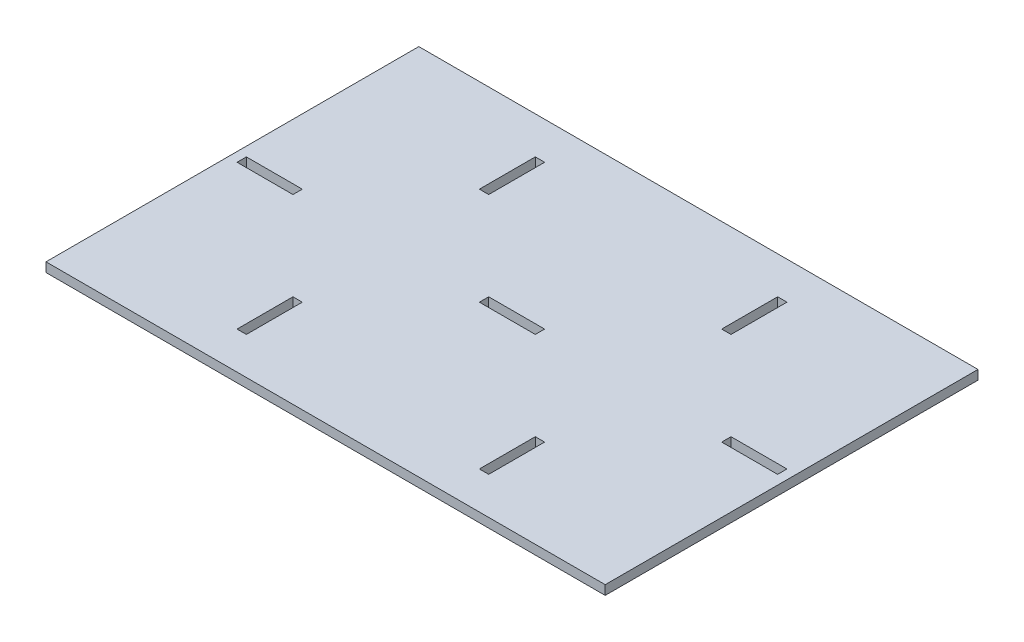
ISO-10303-21;
HEADER;
FILE_DESCRIPTION(('STEP AP214'),'2;1');
FILE_NAME('part.step','',(''),(''),'','','');
FILE_SCHEMA(('AUTOMOTIVE_DESIGN { 1 0 10303 214 1 1 1 1 }'));
ENDSEC;
DATA;
#1=APPLICATION_CONTEXT('core data for automotive mechanical design processes');
#2=APPLICATION_PROTOCOL_DEFINITION('international standard','automotive_design',2000,#1);
#3=PRODUCT_CONTEXT('',#1,'mechanical');
#4=PRODUCT('Part','Part','',(#3));
#5=PRODUCT_RELATED_PRODUCT_CATEGORY('part','',(#4));
#6=PRODUCT_DEFINITION_FORMATION('','',#4);
#7=PRODUCT_DEFINITION_CONTEXT('part definition',#1,'design');
#8=PRODUCT_DEFINITION('design','',#6,#7);
#9=PRODUCT_DEFINITION_SHAPE('','',#8);
#10=(LENGTH_UNIT() NAMED_UNIT(*) SI_UNIT(.MILLI.,.METRE.));
#11=(NAMED_UNIT(*) PLANE_ANGLE_UNIT() SI_UNIT($,.RADIAN.));
#12=(NAMED_UNIT(*) SI_UNIT($,.STERADIAN.) SOLID_ANGLE_UNIT());
#13=UNCERTAINTY_MEASURE_WITH_UNIT(LENGTH_MEASURE(1.E-05),#10,'distance_accuracy_value','');
#14=(GEOMETRIC_REPRESENTATION_CONTEXT(3) GLOBAL_UNCERTAINTY_ASSIGNED_CONTEXT((#13)) GLOBAL_UNIT_ASSIGNED_CONTEXT((#10,
#11,#12)) REPRESENTATION_CONTEXT('',''));
#15=CARTESIAN_POINT('',(0.,0.,0.));
#16=DIRECTION('',(0.,0.,1.));
#17=DIRECTION('',(1.,0.,0.));
#18=AXIS2_PLACEMENT_3D('',#15,#16,#17);
#19=CARTESIAN_POINT('',(-150.,5.,-100.));
#20=DIRECTION('',(1.,0.,0.));
#21=DIRECTION('',(0.,0.,-1.));
#22=AXIS2_PLACEMENT_3D('',#19,#20,#21);
#23=PLANE('',#22);
#24=DIRECTION('',(0.,0.,1.));
#25=VECTOR('',#24,1.);
#26=CARTESIAN_POINT('',(-150.,0.,-100.));
#27=LINE('',#26,#25);
#28=CARTESIAN_POINT('',(-150.,0.,-100.));
#29=VERTEX_POINT('',#28);
#30=CARTESIAN_POINT('',(-150.,0.,100.));
#31=VERTEX_POINT('',#30);
#32=EDGE_CURVE('E278',#29,#31,#27,.T.);
#33=ORIENTED_EDGE('',*,*,#32,.T.);
#34=DIRECTION('',(0.,-1.,0.));
#35=VECTOR('',#34,1.);
#36=CARTESIAN_POINT('',(-150.,5.,100.));
#37=LINE('',#36,#35);
#38=CARTESIAN_POINT('',(-150.,5.,100.));
#39=VERTEX_POINT('',#38);
#40=EDGE_CURVE('E11',#39,#31,#37,.T.);
#41=ORIENTED_EDGE('',*,*,#40,.F.);
#42=DIRECTION('',(0.,0.,1.));
#43=VECTOR('',#42,1.);
#44=CARTESIAN_POINT('',(-150.,5.,-100.));
#45=LINE('',#44,#43);
#46=CARTESIAN_POINT('',(-150.,5.,-100.));
#47=VERTEX_POINT('',#46);
#48=EDGE_CURVE('E471',#47,#39,#45,.T.);
#49=ORIENTED_EDGE('',*,*,#48,.F.);
#50=DIRECTION('',(0.,-1.,0.));
#51=VECTOR('',#50,1.);
#52=CARTESIAN_POINT('',(-150.,5.,-100.));
#53=LINE('',#52,#51);
#54=EDGE_CURVE('E481',#47,#29,#53,.T.);
#55=ORIENTED_EDGE('',*,*,#54,.T.);
#56=EDGE_LOOP('',(#33,#41,#49,#55));
#57=FACE_BOUND('',#56,.T.);
#58=ADVANCED_FACE('F33',(#57),#23,.F.);
#59=CARTESIAN_POINT('',(150.,5.,100.));
#60=DIRECTION('',(0.,0.,-1.));
#61=DIRECTION('',(-1.,0.,0.));
#62=AXIS2_PLACEMENT_3D('',#59,#60,#61);
#63=PLANE('',#62);
#64=DIRECTION('',(1.,0.,0.));
#65=VECTOR('',#64,1.);
#66=CARTESIAN_POINT('',(150.,0.,100.));
#67=LINE('',#66,#65);
#68=CARTESIAN_POINT('',(150.,0.,100.));
#69=VERTEX_POINT('',#68);
#70=EDGE_CURVE('E484',#31,#69,#67,.T.);
#71=ORIENTED_EDGE('',*,*,#70,.T.);
#72=DIRECTION('',(0.,-1.,0.));
#73=VECTOR('',#72,1.);
#74=CARTESIAN_POINT('',(150.,5.,100.));
#75=LINE('',#74,#73);
#76=CARTESIAN_POINT('',(150.,5.,100.));
#77=VERTEX_POINT('',#76);
#78=EDGE_CURVE('E40',#77,#69,#75,.T.);
#79=ORIENTED_EDGE('',*,*,#78,.F.);
#80=DIRECTION('',(1.,0.,0.));
#81=VECTOR('',#80,1.);
#82=CARTESIAN_POINT('',(150.,5.,100.));
#83=LINE('',#82,#81);
#84=EDGE_CURVE('E474',#39,#77,#83,.T.);
#85=ORIENTED_EDGE('',*,*,#84,.F.);
#86=ORIENTED_EDGE('',*,*,#40,.T.);
#87=EDGE_LOOP('',(#71,#79,#85,#86));
#88=FACE_BOUND('',#87,.T.);
#89=ADVANCED_FACE('F513',(#88),#63,.F.);
#90=CARTESIAN_POINT('',(150.,5.,-100.));
#91=DIRECTION('',(-1.,0.,0.));
#92=DIRECTION('',(0.,0.,1.));
#93=AXIS2_PLACEMENT_3D('',#90,#91,#92);
#94=PLANE('',#93);
#95=DIRECTION('',(0.,0.,-1.));
#96=VECTOR('',#95,1.);
#97=CARTESIAN_POINT('',(150.,0.,-100.));
#98=LINE('',#97,#96);
#99=CARTESIAN_POINT('',(150.,0.,-100.));
#100=VERTEX_POINT('',#99);
#101=EDGE_CURVE('E486',#69,#100,#98,.T.);
#102=ORIENTED_EDGE('',*,*,#101,.T.);
#103=DIRECTION('',(0.,-1.,0.));
#104=VECTOR('',#103,1.);
#105=CARTESIAN_POINT('',(150.,5.,-100.));
#106=LINE('',#105,#104);
#107=CARTESIAN_POINT('',(150.,5.,-100.));
#108=VERTEX_POINT('',#107);
#109=EDGE_CURVE('E491',#108,#100,#106,.T.);
#110=ORIENTED_EDGE('',*,*,#109,.F.);
#111=DIRECTION('',(0.,0.,-1.));
#112=VECTOR('',#111,1.);
#113=CARTESIAN_POINT('',(150.,5.,-100.));
#114=LINE('',#113,#112);
#115=EDGE_CURVE('E477',#77,#108,#114,.T.);
#116=ORIENTED_EDGE('',*,*,#115,.F.);
#117=ORIENTED_EDGE('',*,*,#78,.T.);
#118=EDGE_LOOP('',(#102,#110,#116,#117));
#119=FACE_BOUND('',#118,.T.);
#120=ADVANCED_FACE('F498',(#119),#94,.F.);
#121=CARTESIAN_POINT('',(150.,5.,-100.));
#122=DIRECTION('',(0.,0.,1.));
#123=DIRECTION('',(1.,0.,0.));
#124=AXIS2_PLACEMENT_3D('',#121,#122,#123);
#125=PLANE('',#124);
#126=DIRECTION('',(-1.,0.,0.));
#127=VECTOR('',#126,1.);
#128=CARTESIAN_POINT('',(150.,0.,-100.));
#129=LINE('',#128,#127);
#130=EDGE_CURVE('E475',#100,#29,#129,.T.);
#131=ORIENTED_EDGE('',*,*,#130,.T.);
#132=ORIENTED_EDGE('',*,*,#54,.F.);
#133=DIRECTION('',(-1.,0.,0.));
#134=VECTOR('',#133,1.);
#135=CARTESIAN_POINT('',(150.,5.,-100.));
#136=LINE('',#135,#134);
#137=EDGE_CURVE('E479',#108,#47,#136,.T.);
#138=ORIENTED_EDGE('',*,*,#137,.F.);
#139=ORIENTED_EDGE('',*,*,#109,.T.);
#140=EDGE_LOOP('',(#131,#132,#138,#139));
#141=FACE_BOUND('',#140,.T.);
#142=ADVANCED_FACE('F506',(#141),#125,.F.);
#143=CARTESIAN_POINT('',(0.,5.,0.));
#144=DIRECTION('',(0.,-1.,0.));
#145=DIRECTION('',(0.,0.,-1.));
#146=AXIS2_PLACEMENT_3D('',#143,#144,#145);
#147=PLANE('',#146);
#148=DIRECTION('',(1.,0.,0.));
#149=VECTOR('',#148,1.);
#150=CARTESIAN_POINT('',(-115.,5.,2.50000000000001));
#151=LINE('',#150,#149);
#152=CARTESIAN_POINT('',(-145.,5.,2.50000000000001));
#153=VERTEX_POINT('',#152);
#154=CARTESIAN_POINT('',(-115.,5.,2.50000000000001));
#155=VERTEX_POINT('',#154);
#156=EDGE_CURVE('E271',#153,#155,#151,.T.);
#157=ORIENTED_EDGE('',*,*,#156,.F.);
#158=DIRECTION('',(0.,0.,1.));
#159=VECTOR('',#158,1.);
#160=CARTESIAN_POINT('',(-145.,5.,-2.49999999999999));
#161=LINE('',#160,#159);
#162=CARTESIAN_POINT('',(-145.,5.,-2.49999999999999));
#163=VERTEX_POINT('',#162);
#164=EDGE_CURVE('E47',#163,#153,#161,.T.);
#165=ORIENTED_EDGE('',*,*,#164,.F.);
#166=DIRECTION('',(-1.,0.,0.));
#167=VECTOR('',#166,1.);
#168=CARTESIAN_POINT('',(-115.,5.,-2.49999999999999));
#169=LINE('',#168,#167);
#170=CARTESIAN_POINT('',(-115.,5.,-2.49999999999999));
#171=VERTEX_POINT('',#170);
#172=EDGE_CURVE('E262',#171,#163,#169,.T.);
#173=ORIENTED_EDGE('',*,*,#172,.F.);
#174=DIRECTION('',(0.,0.,-1.));
#175=VECTOR('',#174,1.);
#176=CARTESIAN_POINT('',(-115.,5.,-2.49999999999999));
#177=LINE('',#176,#175);
#178=EDGE_CURVE('E265',#155,#171,#177,.T.);
#179=ORIENTED_EDGE('',*,*,#178,.F.);
#180=EDGE_LOOP('',(#157,#165,#173,#179));
#181=FACE_BOUND('',#180,.T.);
#182=DIRECTION('',(1.,0.,0.));
#183=VECTOR('',#182,1.);
#184=CARTESIAN_POINT('',(15.,5.,2.5));
#185=LINE('',#184,#183);
#186=CARTESIAN_POINT('',(-15.,5.,2.50000000000001));
#187=VERTEX_POINT('',#186);
#188=CARTESIAN_POINT('',(15.,5.,2.5));
#189=VERTEX_POINT('',#188);
#190=EDGE_CURVE('E331',#187,#189,#185,.T.);
#191=ORIENTED_EDGE('',*,*,#190,.F.);
#192=DIRECTION('',(0.,0.,1.));
#193=VECTOR('',#192,1.);
#194=CARTESIAN_POINT('',(-15.,5.,-2.50000000000001));
#195=LINE('',#194,#193);
#196=CARTESIAN_POINT('',(-15.,5.,-2.50000000000001));
#197=VERTEX_POINT('',#196);
#198=EDGE_CURVE('E55',#197,#187,#195,.T.);
#199=ORIENTED_EDGE('',*,*,#198,.F.);
#200=DIRECTION('',(-1.,0.,0.));
#201=VECTOR('',#200,1.);
#202=CARTESIAN_POINT('',(15.,5.,-2.50000000000001));
#203=LINE('',#202,#201);
#204=CARTESIAN_POINT('',(15.,5.,-2.50000000000001));
#205=VERTEX_POINT('',#204);
#206=EDGE_CURVE('E320',#205,#197,#203,.T.);
#207=ORIENTED_EDGE('',*,*,#206,.F.);
#208=DIRECTION('',(0.,0.,-1.));
#209=VECTOR('',#208,1.);
#210=CARTESIAN_POINT('',(15.,5.,-2.50000000000001));
#211=LINE('',#210,#209);
#212=EDGE_CURVE('E334',#189,#205,#211,.T.);
#213=ORIENTED_EDGE('',*,*,#212,.F.);
#214=EDGE_LOOP('',(#191,#199,#207,#213));
#215=FACE_BOUND('',#214,.T.);
#216=DIRECTION('',(1.,0.,0.));
#217=VECTOR('',#216,1.);
#218=CARTESIAN_POINT('',(67.5,5.,80.));
#219=LINE('',#218,#217);
#220=CARTESIAN_POINT('',(62.5,5.,80.));
#221=VERTEX_POINT('',#220);
#222=CARTESIAN_POINT('',(67.5,5.,80.));
#223=VERTEX_POINT('',#222);
#224=EDGE_CURVE('E298',#221,#223,#219,.T.);
#225=ORIENTED_EDGE('',*,*,#224,.F.);
#226=DIRECTION('',(0.,0.,1.));
#227=VECTOR('',#226,1.);
#228=CARTESIAN_POINT('',(62.5,5.,80.));
#229=LINE('',#228,#227);
#230=CARTESIAN_POINT('',(62.5,5.,50.));
#231=VERTEX_POINT('',#230);
#232=EDGE_CURVE('E296',#231,#221,#229,.T.);
#233=ORIENTED_EDGE('',*,*,#232,.F.);
#234=DIRECTION('',(-1.,0.,0.));
#235=VECTOR('',#234,1.);
#236=CARTESIAN_POINT('',(67.5,5.,50.));
#237=LINE('',#236,#235);
#238=CARTESIAN_POINT('',(67.5,5.,50.));
#239=VERTEX_POINT('',#238);
#240=EDGE_CURVE('E286',#239,#231,#237,.T.);
#241=ORIENTED_EDGE('',*,*,#240,.F.);
#242=DIRECTION('',(0.,0.,-1.));
#243=VECTOR('',#242,1.);
#244=CARTESIAN_POINT('',(67.5,5.,80.));
#245=LINE('',#244,#243);
#246=EDGE_CURVE('E302',#223,#239,#245,.T.);
#247=ORIENTED_EDGE('',*,*,#246,.F.);
#248=EDGE_LOOP('',(#225,#233,#241,#247));
#249=FACE_BOUND('',#248,.T.);
#250=DIRECTION('',(1.,0.,0.));
#251=VECTOR('',#250,1.);
#252=CARTESIAN_POINT('',(145.,5.,2.50000000000001));
#253=LINE('',#252,#251);
#254=CARTESIAN_POINT('',(115.,5.,2.50000000000001));
#255=VERTEX_POINT('',#254);
#256=CARTESIAN_POINT('',(145.,5.,2.50000000000001));
#257=VERTEX_POINT('',#256);
#258=EDGE_CURVE('E425',#255,#257,#253,.T.);
#259=ORIENTED_EDGE('',*,*,#258,.F.);
#260=DIRECTION('',(0.,0.,1.));
#261=VECTOR('',#260,1.);
#262=CARTESIAN_POINT('',(115.,5.,-2.50000000000005));
#263=LINE('',#262,#261);
#264=CARTESIAN_POINT('',(115.,5.,-2.50000000000005));
#265=VERTEX_POINT('',#264);
#266=EDGE_CURVE('E423',#265,#255,#263,.T.);
#267=ORIENTED_EDGE('',*,*,#266,.F.);
#268=DIRECTION('',(-1.,0.,0.));
#269=VECTOR('',#268,1.);
#270=CARTESIAN_POINT('',(145.,5.,-2.50000000000005));
#271=LINE('',#270,#269);
#272=CARTESIAN_POINT('',(145.,5.,-2.50000000000005));
#273=VERTEX_POINT('',#272);
#274=EDGE_CURVE('E413',#273,#265,#271,.T.);
#275=ORIENTED_EDGE('',*,*,#274,.F.);
#276=DIRECTION('',(0.,0.,-1.));
#277=VECTOR('',#276,1.);
#278=CARTESIAN_POINT('',(145.,5.,-2.50000000000005));
#279=LINE('',#278,#277);
#280=EDGE_CURVE('E429',#257,#273,#279,.T.);
#281=ORIENTED_EDGE('',*,*,#280,.F.);
#282=EDGE_LOOP('',(#259,#267,#275,#281));
#283=FACE_BOUND('',#282,.T.);
#284=DIRECTION('',(1.,0.,0.));
#285=VECTOR('',#284,1.);
#286=CARTESIAN_POINT('',(-62.5,5.,-50.));
#287=LINE('',#286,#285);
#288=CARTESIAN_POINT('',(-67.5,5.,-50.));
#289=VERTEX_POINT('',#288);
#290=CARTESIAN_POINT('',(-62.5,5.,-50.));
#291=VERTEX_POINT('',#290);
#292=EDGE_CURVE('E456',#289,#291,#287,.T.);
#293=ORIENTED_EDGE('',*,*,#292,.F.);
#294=DIRECTION('',(0.,0.,1.));
#295=VECTOR('',#294,1.);
#296=CARTESIAN_POINT('',(-67.5,5.,-80.));
#297=LINE('',#296,#295);
#298=CARTESIAN_POINT('',(-67.5,5.,-80.));
#299=VERTEX_POINT('',#298);
#300=EDGE_CURVE('E372',#299,#289,#297,.T.);
#301=ORIENTED_EDGE('',*,*,#300,.F.);
#302=DIRECTION('',(-1.,0.,0.));
#303=VECTOR('',#302,1.);
#304=CARTESIAN_POINT('',(-62.5,5.,-80.));
#305=LINE('',#304,#303);
#306=CARTESIAN_POINT('',(-62.5,5.,-80.));
#307=VERTEX_POINT('',#306);
#308=EDGE_CURVE('E445',#307,#299,#305,.T.);
#309=ORIENTED_EDGE('',*,*,#308,.F.);
#310=DIRECTION('',(0.,0.,-1.));
#311=VECTOR('',#310,1.);
#312=CARTESIAN_POINT('',(-62.5,5.,-80.));
#313=LINE('',#312,#311);
#314=EDGE_CURVE('E459',#291,#307,#313,.T.);
#315=ORIENTED_EDGE('',*,*,#314,.F.);
#316=EDGE_LOOP('',(#293,#301,#309,#315));
#317=FACE_BOUND('',#316,.T.);
#318=DIRECTION('',(1.,0.,0.));
#319=VECTOR('',#318,1.);
#320=CARTESIAN_POINT('',(-62.5,5.,80.));
#321=LINE('',#320,#319);
#322=CARTESIAN_POINT('',(-67.5,5.,80.));
#323=VERTEX_POINT('',#322);
#324=CARTESIAN_POINT('',(-62.5,5.,80.));
#325=VERTEX_POINT('',#324);
#326=EDGE_CURVE('E361',#323,#325,#321,.T.);
#327=ORIENTED_EDGE('',*,*,#326,.F.);
#328=DIRECTION('',(0.,0.,1.));
#329=VECTOR('',#328,1.);
#330=CARTESIAN_POINT('',(-67.5,5.,50.));
#331=LINE('',#330,#329);
#332=CARTESIAN_POINT('',(-67.5,5.,50.));
#333=VERTEX_POINT('',#332);
#334=EDGE_CURVE('E359',#333,#323,#331,.T.);
#335=ORIENTED_EDGE('',*,*,#334,.F.);
#336=DIRECTION('',(-1.,0.,0.));
#337=VECTOR('',#336,1.);
#338=CARTESIAN_POINT('',(-62.5,5.,50.));
#339=LINE('',#338,#337);
#340=CARTESIAN_POINT('',(-62.5,5.,50.));
#341=VERTEX_POINT('',#340);
#342=EDGE_CURVE('E349',#341,#333,#339,.T.);
#343=ORIENTED_EDGE('',*,*,#342,.F.);
#344=DIRECTION('',(0.,0.,-1.));
#345=VECTOR('',#344,1.);
#346=CARTESIAN_POINT('',(-62.5,5.,50.));
#347=LINE('',#346,#345);
#348=EDGE_CURVE('E365',#325,#341,#347,.T.);
#349=ORIENTED_EDGE('',*,*,#348,.F.);
#350=EDGE_LOOP('',(#327,#335,#343,#349));
#351=FACE_BOUND('',#350,.T.);
#352=DIRECTION('',(1.,0.,0.));
#353=VECTOR('',#352,1.);
#354=CARTESIAN_POINT('',(67.5,5.,-50.));
#355=LINE('',#354,#353);
#356=CARTESIAN_POINT('',(62.5,5.,-50.));
#357=VERTEX_POINT('',#356);
#358=CARTESIAN_POINT('',(67.5,5.,-50.));
#359=VERTEX_POINT('',#358);
#360=EDGE_CURVE('E394',#357,#359,#355,.T.);
#361=ORIENTED_EDGE('',*,*,#360,.F.);
#362=DIRECTION('',(0.,0.,1.));
#363=VECTOR('',#362,1.);
#364=CARTESIAN_POINT('',(62.5,5.,-80.0000000000001));
#365=LINE('',#364,#363);
#366=CARTESIAN_POINT('',(62.5,5.,-80.0000000000001));
#367=VERTEX_POINT('',#366);
#368=EDGE_CURVE('E309',#367,#357,#365,.T.);
#369=ORIENTED_EDGE('',*,*,#368,.F.);
#370=DIRECTION('',(-1.,0.,0.));
#371=VECTOR('',#370,1.);
#372=CARTESIAN_POINT('',(67.5,5.,-80.0000000000001));
#373=LINE('',#372,#371);
#374=CARTESIAN_POINT('',(67.5,5.,-80.0000000000001));
#375=VERTEX_POINT('',#374);
#376=EDGE_CURVE('E383',#375,#367,#373,.T.);
#377=ORIENTED_EDGE('',*,*,#376,.F.);
#378=DIRECTION('',(0.,0.,-1.));
#379=VECTOR('',#378,1.);
#380=CARTESIAN_POINT('',(67.5,5.,-80.0000000000001));
#381=LINE('',#380,#379);
#382=EDGE_CURVE('E397',#359,#375,#381,.T.);
#383=ORIENTED_EDGE('',*,*,#382,.F.);
#384=EDGE_LOOP('',(#361,#369,#377,#383));
#385=FACE_BOUND('',#384,.T.);
#386=ORIENTED_EDGE('',*,*,#48,.T.);
#387=ORIENTED_EDGE('',*,*,#84,.T.);
#388=ORIENTED_EDGE('',*,*,#115,.T.);
#389=ORIENTED_EDGE('',*,*,#137,.T.);
#390=EDGE_LOOP('',(#386,#387,#388,#389));
#391=FACE_BOUND('',#390,.T.);
#392=ADVANCED_FACE('F512',(#181,#215,#249,#283,#317,#351,#385,#391),#147,.F.);
#393=CARTESIAN_POINT('',(0.,0.,0.));
#394=DIRECTION('',(0.,-1.,0.));
#395=DIRECTION('',(0.,0.,-1.));
#396=AXIS2_PLACEMENT_3D('',#393,#394,#395);
#397=PLANE('',#396);
#398=DIRECTION('',(0.,0.,1.));
#399=VECTOR('',#398,1.);
#400=CARTESIAN_POINT('',(-145.,0.,-2.49999999999999));
#401=LINE('',#400,#399);
#402=CARTESIAN_POINT('',(-145.,0.,-2.49999999999999));
#403=VERTEX_POINT('',#402);
#404=CARTESIAN_POINT('',(-145.,0.,2.50000000000001));
#405=VERTEX_POINT('',#404);
#406=EDGE_CURVE('E243',#403,#405,#401,.T.);
#407=ORIENTED_EDGE('',*,*,#406,.T.);
#408=DIRECTION('',(1.,0.,0.));
#409=VECTOR('',#408,1.);
#410=CARTESIAN_POINT('',(-115.,0.,2.50000000000001));
#411=LINE('',#410,#409);
#412=CARTESIAN_POINT('',(-115.,0.,2.50000000000001));
#413=VERTEX_POINT('',#412);
#414=EDGE_CURVE('E253',#405,#413,#411,.T.);
#415=ORIENTED_EDGE('',*,*,#414,.T.);
#416=DIRECTION('',(0.,0.,-1.));
#417=VECTOR('',#416,1.);
#418=CARTESIAN_POINT('',(-115.,0.,-2.49999999999999));
#419=LINE('',#418,#417);
#420=CARTESIAN_POINT('',(-115.,0.,-2.49999999999999));
#421=VERTEX_POINT('',#420);
#422=EDGE_CURVE('E257',#413,#421,#419,.T.);
#423=ORIENTED_EDGE('',*,*,#422,.T.);
#424=DIRECTION('',(-1.,0.,0.));
#425=VECTOR('',#424,1.);
#426=CARTESIAN_POINT('',(-115.,0.,-2.49999999999999));
#427=LINE('',#426,#425);
#428=EDGE_CURVE('E249',#421,#403,#427,.T.);
#429=ORIENTED_EDGE('',*,*,#428,.T.);
#430=EDGE_LOOP('',(#407,#415,#423,#429));
#431=FACE_BOUND('',#430,.T.);
#432=DIRECTION('',(0.,0.,1.));
#433=VECTOR('',#432,1.);
#434=CARTESIAN_POINT('',(-15.,0.,-2.50000000000001));
#435=LINE('',#434,#433);
#436=CARTESIAN_POINT('',(-15.,0.,-2.50000000000001));
#437=VERTEX_POINT('',#436);
#438=CARTESIAN_POINT('',(-15.,0.,2.50000000000001));
#439=VERTEX_POINT('',#438);
#440=EDGE_CURVE('E316',#437,#439,#435,.T.);
#441=ORIENTED_EDGE('',*,*,#440,.T.);
#442=DIRECTION('',(1.,0.,0.));
#443=VECTOR('',#442,1.);
#444=CARTESIAN_POINT('',(15.,0.,2.5));
#445=LINE('',#444,#443);
#446=CARTESIAN_POINT('',(15.,0.,2.5));
#447=VERTEX_POINT('',#446);
#448=EDGE_CURVE('E319',#439,#447,#445,.T.);
#449=ORIENTED_EDGE('',*,*,#448,.T.);
#450=DIRECTION('',(0.,0.,-1.));
#451=VECTOR('',#450,1.);
#452=CARTESIAN_POINT('',(15.,0.,-2.50000000000001));
#453=LINE('',#452,#451);
#454=CARTESIAN_POINT('',(15.,0.,-2.50000000000001));
#455=VERTEX_POINT('',#454);
#456=EDGE_CURVE('E323',#447,#455,#453,.T.);
#457=ORIENTED_EDGE('',*,*,#456,.T.);
#458=DIRECTION('',(-1.,0.,0.));
#459=VECTOR('',#458,1.);
#460=CARTESIAN_POINT('',(15.,0.,-2.50000000000001));
#461=LINE('',#460,#459);
#462=EDGE_CURVE('E326',#455,#437,#461,.T.);
#463=ORIENTED_EDGE('',*,*,#462,.T.);
#464=EDGE_LOOP('',(#441,#449,#457,#463));
#465=FACE_BOUND('',#464,.T.);
#466=DIRECTION('',(0.,0.,1.));
#467=VECTOR('',#466,1.);
#468=CARTESIAN_POINT('',(62.5,0.,80.));
#469=LINE('',#468,#467);
#470=CARTESIAN_POINT('',(62.5,0.,50.));
#471=VERTEX_POINT('',#470);
#472=CARTESIAN_POINT('',(62.5,0.,80.));
#473=VERTEX_POINT('',#472);
#474=EDGE_CURVE('E282',#471,#473,#469,.T.);
#475=ORIENTED_EDGE('',*,*,#474,.T.);
#476=DIRECTION('',(1.,0.,0.));
#477=VECTOR('',#476,1.);
#478=CARTESIAN_POINT('',(67.5,0.,80.));
#479=LINE('',#478,#477);
#480=CARTESIAN_POINT('',(67.5,0.,80.));
#481=VERTEX_POINT('',#480);
#482=EDGE_CURVE('E285',#473,#481,#479,.T.);
#483=ORIENTED_EDGE('',*,*,#482,.T.);
#484=DIRECTION('',(0.,0.,-1.));
#485=VECTOR('',#484,1.);
#486=CARTESIAN_POINT('',(67.5,0.,80.));
#487=LINE('',#486,#485);
#488=CARTESIAN_POINT('',(67.5,0.,50.));
#489=VERTEX_POINT('',#488);
#490=EDGE_CURVE('E289',#481,#489,#487,.T.);
#491=ORIENTED_EDGE('',*,*,#490,.T.);
#492=DIRECTION('',(-1.,0.,0.));
#493=VECTOR('',#492,1.);
#494=CARTESIAN_POINT('',(67.5,0.,50.));
#495=LINE('',#494,#493);
#496=EDGE_CURVE('E292',#489,#471,#495,.T.);
#497=ORIENTED_EDGE('',*,*,#496,.T.);
#498=EDGE_LOOP('',(#475,#483,#491,#497));
#499=FACE_BOUND('',#498,.T.);
#500=DIRECTION('',(0.,0.,1.));
#501=VECTOR('',#500,1.);
#502=CARTESIAN_POINT('',(115.,0.,-2.50000000000005));
#503=LINE('',#502,#501);
#504=CARTESIAN_POINT('',(115.,0.,-2.50000000000005));
#505=VERTEX_POINT('',#504);
#506=CARTESIAN_POINT('',(115.,0.,2.50000000000001));
#507=VERTEX_POINT('',#506);
#508=EDGE_CURVE('E409',#505,#507,#503,.T.);
#509=ORIENTED_EDGE('',*,*,#508,.T.);
#510=DIRECTION('',(1.,0.,0.));
#511=VECTOR('',#510,1.);
#512=CARTESIAN_POINT('',(145.,0.,2.50000000000001));
#513=LINE('',#512,#511);
#514=CARTESIAN_POINT('',(145.,0.,2.50000000000001));
#515=VERTEX_POINT('',#514);
#516=EDGE_CURVE('E412',#507,#515,#513,.T.);
#517=ORIENTED_EDGE('',*,*,#516,.T.);
#518=DIRECTION('',(0.,0.,-1.));
#519=VECTOR('',#518,1.);
#520=CARTESIAN_POINT('',(145.,0.,-2.50000000000005));
#521=LINE('',#520,#519);
#522=CARTESIAN_POINT('',(145.,0.,-2.50000000000005));
#523=VERTEX_POINT('',#522);
#524=EDGE_CURVE('E416',#515,#523,#521,.T.);
#525=ORIENTED_EDGE('',*,*,#524,.T.);
#526=DIRECTION('',(-1.,0.,0.));
#527=VECTOR('',#526,1.);
#528=CARTESIAN_POINT('',(145.,0.,-2.50000000000005));
#529=LINE('',#528,#527);
#530=EDGE_CURVE('E419',#523,#505,#529,.T.);
#531=ORIENTED_EDGE('',*,*,#530,.T.);
#532=EDGE_LOOP('',(#509,#517,#525,#531));
#533=FACE_BOUND('',#532,.T.);
#534=DIRECTION('',(0.,0.,1.));
#535=VECTOR('',#534,1.);
#536=CARTESIAN_POINT('',(-67.5,0.,-80.));
#537=LINE('',#536,#535);
#538=CARTESIAN_POINT('',(-67.5,0.,-80.));
#539=VERTEX_POINT('',#538);
#540=CARTESIAN_POINT('',(-67.5,0.,-50.));
#541=VERTEX_POINT('',#540);
#542=EDGE_CURVE('E441',#539,#541,#537,.T.);
#543=ORIENTED_EDGE('',*,*,#542,.T.);
#544=DIRECTION('',(1.,0.,0.));
#545=VECTOR('',#544,1.);
#546=CARTESIAN_POINT('',(-62.5,0.,-50.));
#547=LINE('',#546,#545);
#548=CARTESIAN_POINT('',(-62.5,0.,-50.));
#549=VERTEX_POINT('',#548);
#550=EDGE_CURVE('E444',#541,#549,#547,.T.);
#551=ORIENTED_EDGE('',*,*,#550,.T.);
#552=DIRECTION('',(0.,0.,-1.));
#553=VECTOR('',#552,1.);
#554=CARTESIAN_POINT('',(-62.5,0.,-80.));
#555=LINE('',#554,#553);
#556=CARTESIAN_POINT('',(-62.5,0.,-80.));
#557=VERTEX_POINT('',#556);
#558=EDGE_CURVE('E448',#549,#557,#555,.T.);
#559=ORIENTED_EDGE('',*,*,#558,.T.);
#560=DIRECTION('',(-1.,0.,0.));
#561=VECTOR('',#560,1.);
#562=CARTESIAN_POINT('',(-62.5,0.,-80.));
#563=LINE('',#562,#561);
#564=EDGE_CURVE('E451',#557,#539,#563,.T.);
#565=ORIENTED_EDGE('',*,*,#564,.T.);
#566=EDGE_LOOP('',(#543,#551,#559,#565));
#567=FACE_BOUND('',#566,.T.);
#568=DIRECTION('',(0.,0.,1.));
#569=VECTOR('',#568,1.);
#570=CARTESIAN_POINT('',(-67.5,0.,50.));
#571=LINE('',#570,#569);
#572=CARTESIAN_POINT('',(-67.5,0.,50.));
#573=VERTEX_POINT('',#572);
#574=CARTESIAN_POINT('',(-67.5,0.,80.));
#575=VERTEX_POINT('',#574);
#576=EDGE_CURVE('E345',#573,#575,#571,.T.);
#577=ORIENTED_EDGE('',*,*,#576,.T.);
#578=DIRECTION('',(1.,0.,0.));
#579=VECTOR('',#578,1.);
#580=CARTESIAN_POINT('',(-62.5,0.,80.));
#581=LINE('',#580,#579);
#582=CARTESIAN_POINT('',(-62.5,0.,80.));
#583=VERTEX_POINT('',#582);
#584=EDGE_CURVE('E348',#575,#583,#581,.T.);
#585=ORIENTED_EDGE('',*,*,#584,.T.);
#586=DIRECTION('',(0.,0.,-1.));
#587=VECTOR('',#586,1.);
#588=CARTESIAN_POINT('',(-62.5,0.,50.));
#589=LINE('',#588,#587);
#590=CARTESIAN_POINT('',(-62.5,0.,50.));
#591=VERTEX_POINT('',#590);
#592=EDGE_CURVE('E352',#583,#591,#589,.T.);
#593=ORIENTED_EDGE('',*,*,#592,.T.);
#594=DIRECTION('',(-1.,0.,0.));
#595=VECTOR('',#594,1.);
#596=CARTESIAN_POINT('',(-62.5,0.,50.));
#597=LINE('',#596,#595);
#598=EDGE_CURVE('E355',#591,#573,#597,.T.);
#599=ORIENTED_EDGE('',*,*,#598,.T.);
#600=EDGE_LOOP('',(#577,#585,#593,#599));
#601=FACE_BOUND('',#600,.T.);
#602=DIRECTION('',(0.,0.,1.));
#603=VECTOR('',#602,1.);
#604=CARTESIAN_POINT('',(62.5,0.,-80.0000000000001));
#605=LINE('',#604,#603);
#606=CARTESIAN_POINT('',(62.5,0.,-80.0000000000001));
#607=VERTEX_POINT('',#606);
#608=CARTESIAN_POINT('',(62.5,0.,-50.));
#609=VERTEX_POINT('',#608);
#610=EDGE_CURVE('E379',#607,#609,#605,.T.);
#611=ORIENTED_EDGE('',*,*,#610,.T.);
#612=DIRECTION('',(1.,0.,0.));
#613=VECTOR('',#612,1.);
#614=CARTESIAN_POINT('',(67.5,0.,-50.));
#615=LINE('',#614,#613);
#616=CARTESIAN_POINT('',(67.5,0.,-50.));
#617=VERTEX_POINT('',#616);
#618=EDGE_CURVE('E382',#609,#617,#615,.T.);
#619=ORIENTED_EDGE('',*,*,#618,.T.);
#620=DIRECTION('',(0.,0.,-1.));
#621=VECTOR('',#620,1.);
#622=CARTESIAN_POINT('',(67.5,0.,-80.0000000000001));
#623=LINE('',#622,#621);
#624=CARTESIAN_POINT('',(67.5,0.,-80.0000000000001));
#625=VERTEX_POINT('',#624);
#626=EDGE_CURVE('E386',#617,#625,#623,.T.);
#627=ORIENTED_EDGE('',*,*,#626,.T.);
#628=DIRECTION('',(-1.,0.,0.));
#629=VECTOR('',#628,1.);
#630=CARTESIAN_POINT('',(67.5,0.,-80.0000000000001));
#631=LINE('',#630,#629);
#632=EDGE_CURVE('E389',#625,#607,#631,.T.);
#633=ORIENTED_EDGE('',*,*,#632,.T.);
#634=EDGE_LOOP('',(#611,#619,#627,#633));
#635=FACE_BOUND('',#634,.T.);
#636=ORIENTED_EDGE('',*,*,#32,.F.);
#637=ORIENTED_EDGE('',*,*,#130,.F.);
#638=ORIENTED_EDGE('',*,*,#101,.F.);
#639=ORIENTED_EDGE('',*,*,#70,.F.);
#640=EDGE_LOOP('',(#636,#637,#638,#639));
#641=FACE_BOUND('',#640,.T.);
#642=ADVANCED_FACE('F259',(#431,#465,#499,#533,#567,#601,#635,#641),#397,.T.);
#643=CARTESIAN_POINT('',(62.5,0.,-80.0000000000001));
#644=DIRECTION('',(-1.,0.,0.));
#645=DIRECTION('',(0.,0.,1.));
#646=AXIS2_PLACEMENT_3D('',#643,#644,#645);
#647=PLANE('',#646);
#648=ORIENTED_EDGE('',*,*,#368,.T.);
#649=DIRECTION('',(0.,1.,0.));
#650=VECTOR('',#649,1.);
#651=CARTESIAN_POINT('',(62.5,0.,-50.));
#652=LINE('',#651,#650);
#653=EDGE_CURVE('E392',#609,#357,#652,.T.);
#654=ORIENTED_EDGE('',*,*,#653,.F.);
#655=ORIENTED_EDGE('',*,*,#610,.F.);
#656=DIRECTION('',(0.,1.,0.));
#657=VECTOR('',#656,1.);
#658=CARTESIAN_POINT('',(62.5,0.,-80.0000000000001));
#659=LINE('',#658,#657);
#660=EDGE_CURVE('E362',#607,#367,#659,.T.);
#661=ORIENTED_EDGE('',*,*,#660,.T.);
#662=EDGE_LOOP('',(#648,#654,#655,#661));
#663=FACE_BOUND('',#662,.T.);
#664=ADVANCED_FACE('F525',(#663),#647,.F.);
#665=CARTESIAN_POINT('',(67.5,0.,-80.0000000000001));
#666=DIRECTION('',(0.,0.,-1.));
#667=DIRECTION('',(-1.,0.,0.));
#668=AXIS2_PLACEMENT_3D('',#665,#666,#667);
#669=PLANE('',#668);
#670=ORIENTED_EDGE('',*,*,#376,.T.);
#671=ORIENTED_EDGE('',*,*,#660,.F.);
#672=ORIENTED_EDGE('',*,*,#632,.F.);
#673=DIRECTION('',(0.,1.,0.));
#674=VECTOR('',#673,1.);
#675=CARTESIAN_POINT('',(67.5,0.,-80.0000000000001));
#676=LINE('',#675,#674);
#677=EDGE_CURVE('E403',#625,#375,#676,.T.);
#678=ORIENTED_EDGE('',*,*,#677,.T.);
#679=EDGE_LOOP('',(#670,#671,#672,#678));
#680=FACE_BOUND('',#679,.T.);
#681=ADVANCED_FACE('F565',(#680),#669,.F.);
#682=CARTESIAN_POINT('',(67.5,0.,-80.0000000000001));
#683=DIRECTION('',(1.,0.,0.));
#684=DIRECTION('',(0.,0.,-1.));
#685=AXIS2_PLACEMENT_3D('',#682,#683,#684);
#686=PLANE('',#685);
#687=ORIENTED_EDGE('',*,*,#382,.T.);
#688=ORIENTED_EDGE('',*,*,#677,.F.);
#689=ORIENTED_EDGE('',*,*,#626,.F.);
#690=DIRECTION('',(0.,1.,0.));
#691=VECTOR('',#690,1.);
#692=CARTESIAN_POINT('',(67.5,0.,-50.));
#693=LINE('',#692,#691);
#694=EDGE_CURVE('E405',#617,#359,#693,.T.);
#695=ORIENTED_EDGE('',*,*,#694,.T.);
#696=EDGE_LOOP('',(#687,#688,#689,#695));
#697=FACE_BOUND('',#696,.T.);
#698=ADVANCED_FACE('F571',(#697),#686,.F.);
#699=CARTESIAN_POINT('',(67.5,0.,-50.));
#700=DIRECTION('',(0.,0.,1.));
#701=DIRECTION('',(1.,0.,0.));
#702=AXIS2_PLACEMENT_3D('',#699,#700,#701);
#703=PLANE('',#702);
#704=ORIENTED_EDGE('',*,*,#360,.T.);
#705=ORIENTED_EDGE('',*,*,#694,.F.);
#706=ORIENTED_EDGE('',*,*,#618,.F.);
#707=ORIENTED_EDGE('',*,*,#653,.T.);
#708=EDGE_LOOP('',(#704,#705,#706,#707));
#709=FACE_BOUND('',#708,.T.);
#710=ADVANCED_FACE('F567',(#709),#703,.F.);
#711=CARTESIAN_POINT('',(-67.5,0.,50.));
#712=DIRECTION('',(-1.,0.,0.));
#713=DIRECTION('',(0.,0.,1.));
#714=AXIS2_PLACEMENT_3D('',#711,#712,#713);
#715=PLANE('',#714);
#716=ORIENTED_EDGE('',*,*,#334,.T.);
#717=DIRECTION('',(0.,1.,0.));
#718=VECTOR('',#717,1.);
#719=CARTESIAN_POINT('',(-67.5,0.,80.));
#720=LINE('',#719,#718);
#721=EDGE_CURVE('E358',#575,#323,#720,.T.);
#722=ORIENTED_EDGE('',*,*,#721,.F.);
#723=ORIENTED_EDGE('',*,*,#576,.F.);
#724=DIRECTION('',(0.,1.,0.));
#725=VECTOR('',#724,1.);
#726=CARTESIAN_POINT('',(-67.5,0.,50.));
#727=LINE('',#726,#725);
#728=EDGE_CURVE('E370',#573,#333,#727,.T.);
#729=ORIENTED_EDGE('',*,*,#728,.T.);
#730=EDGE_LOOP('',(#716,#722,#723,#729));
#731=FACE_BOUND('',#730,.T.);
#732=ADVANCED_FACE('F570',(#731),#715,.F.);
#733=CARTESIAN_POINT('',(-62.5,0.,50.));
#734=DIRECTION('',(0.,0.,-1.));
#735=DIRECTION('',(-1.,0.,0.));
#736=AXIS2_PLACEMENT_3D('',#733,#734,#735);
#737=PLANE('',#736);
#738=ORIENTED_EDGE('',*,*,#342,.T.);
#739=ORIENTED_EDGE('',*,*,#728,.F.);
#740=ORIENTED_EDGE('',*,*,#598,.F.);
#741=DIRECTION('',(0.,1.,0.));
#742=VECTOR('',#741,1.);
#743=CARTESIAN_POINT('',(-62.5,0.,50.));
#744=LINE('',#743,#742);
#745=EDGE_CURVE('E373',#591,#341,#744,.T.);
#746=ORIENTED_EDGE('',*,*,#745,.T.);
#747=EDGE_LOOP('',(#738,#739,#740,#746));
#748=FACE_BOUND('',#747,.T.);
#749=ADVANCED_FACE('F581',(#748),#737,.F.);
#750=CARTESIAN_POINT('',(-62.5,0.,50.));
#751=DIRECTION('',(1.,0.,0.));
#752=DIRECTION('',(0.,0.,-1.));
#753=AXIS2_PLACEMENT_3D('',#750,#751,#752);
#754=PLANE('',#753);
#755=ORIENTED_EDGE('',*,*,#348,.T.);
#756=ORIENTED_EDGE('',*,*,#745,.F.);
#757=ORIENTED_EDGE('',*,*,#592,.F.);
#758=DIRECTION('',(0.,1.,0.));
#759=VECTOR('',#758,1.);
#760=CARTESIAN_POINT('',(-62.5,0.,80.));
#761=LINE('',#760,#759);
#762=EDGE_CURVE('E375',#583,#325,#761,.T.);
#763=ORIENTED_EDGE('',*,*,#762,.T.);
#764=EDGE_LOOP('',(#755,#756,#757,#763));
#765=FACE_BOUND('',#764,.T.);
#766=ADVANCED_FACE('F585',(#765),#754,.F.);
#767=CARTESIAN_POINT('',(-62.5,0.,80.));
#768=DIRECTION('',(0.,0.,1.));
#769=DIRECTION('',(1.,0.,0.));
#770=AXIS2_PLACEMENT_3D('',#767,#768,#769);
#771=PLANE('',#770);
#772=ORIENTED_EDGE('',*,*,#326,.T.);
#773=ORIENTED_EDGE('',*,*,#762,.F.);
#774=ORIENTED_EDGE('',*,*,#584,.F.);
#775=ORIENTED_EDGE('',*,*,#721,.T.);
#776=EDGE_LOOP('',(#772,#773,#774,#775));
#777=FACE_BOUND('',#776,.T.);
#778=ADVANCED_FACE('F533',(#777),#771,.F.);
#779=CARTESIAN_POINT('',(-67.5,0.,-80.));
#780=DIRECTION('',(-1.,0.,0.));
#781=DIRECTION('',(0.,0.,1.));
#782=AXIS2_PLACEMENT_3D('',#779,#780,#781);
#783=PLANE('',#782);
#784=ORIENTED_EDGE('',*,*,#300,.T.);
#785=DIRECTION('',(0.,1.,0.));
#786=VECTOR('',#785,1.);
#787=CARTESIAN_POINT('',(-67.5,0.,-50.));
#788=LINE('',#787,#786);
#789=EDGE_CURVE('E454',#541,#289,#788,.T.);
#790=ORIENTED_EDGE('',*,*,#789,.F.);
#791=ORIENTED_EDGE('',*,*,#542,.F.);
#792=DIRECTION('',(0.,1.,0.));
#793=VECTOR('',#792,1.);
#794=CARTESIAN_POINT('',(-67.5,0.,-80.));
#795=LINE('',#794,#793);
#796=EDGE_CURVE('E426',#539,#299,#795,.T.);
#797=ORIENTED_EDGE('',*,*,#796,.T.);
#798=EDGE_LOOP('',(#784,#790,#791,#797));
#799=FACE_BOUND('',#798,.T.);
#800=ADVANCED_FACE('F529',(#799),#783,.F.);
#801=CARTESIAN_POINT('',(-62.5,0.,-80.));
#802=DIRECTION('',(0.,0.,-1.));
#803=DIRECTION('',(-1.,0.,0.));
#804=AXIS2_PLACEMENT_3D('',#801,#802,#803);
#805=PLANE('',#804);
#806=ORIENTED_EDGE('',*,*,#308,.T.);
#807=ORIENTED_EDGE('',*,*,#796,.F.);
#808=ORIENTED_EDGE('',*,*,#564,.F.);
#809=DIRECTION('',(0.,1.,0.));
#810=VECTOR('',#809,1.);
#811=CARTESIAN_POINT('',(-62.5,0.,-80.));
#812=LINE('',#811,#810);
#813=EDGE_CURVE('E465',#557,#307,#812,.T.);
#814=ORIENTED_EDGE('',*,*,#813,.T.);
#815=EDGE_LOOP('',(#806,#807,#808,#814));
#816=FACE_BOUND('',#815,.T.);
#817=ADVANCED_FACE('F532',(#816),#805,.F.);
#818=CARTESIAN_POINT('',(-62.5,0.,-80.));
#819=DIRECTION('',(1.,0.,0.));
#820=DIRECTION('',(0.,0.,-1.));
#821=AXIS2_PLACEMENT_3D('',#818,#819,#820);
#822=PLANE('',#821);
#823=ORIENTED_EDGE('',*,*,#314,.T.);
#824=ORIENTED_EDGE('',*,*,#813,.F.);
#825=ORIENTED_EDGE('',*,*,#558,.F.);
#826=DIRECTION('',(0.,1.,0.));
#827=VECTOR('',#826,1.);
#828=CARTESIAN_POINT('',(-62.5,0.,-50.));
#829=LINE('',#828,#827);
#830=EDGE_CURVE('E467',#549,#291,#829,.T.);
#831=ORIENTED_EDGE('',*,*,#830,.T.);
#832=EDGE_LOOP('',(#823,#824,#825,#831));
#833=FACE_BOUND('',#832,.T.);
#834=ADVANCED_FACE('F539',(#833),#822,.F.);
#835=CARTESIAN_POINT('',(-62.5,0.,-50.));
#836=DIRECTION('',(0.,0.,1.));
#837=DIRECTION('',(1.,0.,0.));
#838=AXIS2_PLACEMENT_3D('',#835,#836,#837);
#839=PLANE('',#838);
#840=ORIENTED_EDGE('',*,*,#292,.T.);
#841=ORIENTED_EDGE('',*,*,#830,.F.);
#842=ORIENTED_EDGE('',*,*,#550,.F.);
#843=ORIENTED_EDGE('',*,*,#789,.T.);
#844=EDGE_LOOP('',(#840,#841,#842,#843));
#845=FACE_BOUND('',#844,.T.);
#846=ADVANCED_FACE('F535',(#845),#839,.F.);
#847=CARTESIAN_POINT('',(115.,0.,-2.50000000000005));
#848=DIRECTION('',(-1.,0.,0.));
#849=DIRECTION('',(0.,0.,1.));
#850=AXIS2_PLACEMENT_3D('',#847,#848,#849);
#851=PLANE('',#850);
#852=ORIENTED_EDGE('',*,*,#266,.T.);
#853=DIRECTION('',(0.,1.,0.));
#854=VECTOR('',#853,1.);
#855=CARTESIAN_POINT('',(115.,0.,2.50000000000001));
#856=LINE('',#855,#854);
#857=EDGE_CURVE('E422',#507,#255,#856,.T.);
#858=ORIENTED_EDGE('',*,*,#857,.F.);
#859=ORIENTED_EDGE('',*,*,#508,.F.);
#860=DIRECTION('',(0.,1.,0.));
#861=VECTOR('',#860,1.);
#862=CARTESIAN_POINT('',(115.,0.,-2.50000000000005));
#863=LINE('',#862,#861);
#864=EDGE_CURVE('E272',#505,#265,#863,.T.);
#865=ORIENTED_EDGE('',*,*,#864,.T.);
#866=EDGE_LOOP('',(#852,#858,#859,#865));
#867=FACE_BOUND('',#866,.T.);
#868=ADVANCED_FACE('F538',(#867),#851,.F.);
#869=CARTESIAN_POINT('',(145.,0.,-2.50000000000005));
#870=DIRECTION('',(0.,0.,-1.));
#871=DIRECTION('',(-1.,0.,0.));
#872=AXIS2_PLACEMENT_3D('',#869,#870,#871);
#873=PLANE('',#872);
#874=ORIENTED_EDGE('',*,*,#274,.T.);
#875=ORIENTED_EDGE('',*,*,#864,.F.);
#876=ORIENTED_EDGE('',*,*,#530,.F.);
#877=DIRECTION('',(0.,1.,0.));
#878=VECTOR('',#877,1.);
#879=CARTESIAN_POINT('',(145.,0.,-2.50000000000005));
#880=LINE('',#879,#878);
#881=EDGE_CURVE('E435',#523,#273,#880,.T.);
#882=ORIENTED_EDGE('',*,*,#881,.T.);
#883=EDGE_LOOP('',(#874,#875,#876,#882));
#884=FACE_BOUND('',#883,.T.);
#885=ADVANCED_FACE('F549',(#884),#873,.F.);
#886=CARTESIAN_POINT('',(145.,0.,-2.50000000000005));
#887=DIRECTION('',(1.,0.,0.));
#888=DIRECTION('',(0.,0.,-1.));
#889=AXIS2_PLACEMENT_3D('',#886,#887,#888);
#890=PLANE('',#889);
#891=ORIENTED_EDGE('',*,*,#280,.T.);
#892=ORIENTED_EDGE('',*,*,#881,.F.);
#893=ORIENTED_EDGE('',*,*,#524,.F.);
#894=DIRECTION('',(0.,1.,0.));
#895=VECTOR('',#894,1.);
#896=CARTESIAN_POINT('',(145.,0.,2.50000000000001));
#897=LINE('',#896,#895);
#898=EDGE_CURVE('E437',#515,#257,#897,.T.);
#899=ORIENTED_EDGE('',*,*,#898,.T.);
#900=EDGE_LOOP('',(#891,#892,#893,#899));
#901=FACE_BOUND('',#900,.T.);
#902=ADVANCED_FACE('F555',(#901),#890,.F.);
#903=CARTESIAN_POINT('',(145.,0.,2.50000000000001));
#904=DIRECTION('',(0.,0.,1.));
#905=DIRECTION('',(1.,0.,0.));
#906=AXIS2_PLACEMENT_3D('',#903,#904,#905);
#907=PLANE('',#906);
#908=ORIENTED_EDGE('',*,*,#258,.T.);
#909=ORIENTED_EDGE('',*,*,#898,.F.);
#910=ORIENTED_EDGE('',*,*,#516,.F.);
#911=ORIENTED_EDGE('',*,*,#857,.T.);
#912=EDGE_LOOP('',(#908,#909,#910,#911));
#913=FACE_BOUND('',#912,.T.);
#914=ADVANCED_FACE('F551',(#913),#907,.F.);
#915=CARTESIAN_POINT('',(62.5,0.,80.));
#916=DIRECTION('',(-1.,0.,0.));
#917=DIRECTION('',(0.,0.,1.));
#918=AXIS2_PLACEMENT_3D('',#915,#916,#917);
#919=PLANE('',#918);
#920=ORIENTED_EDGE('',*,*,#232,.T.);
#921=DIRECTION('',(0.,1.,0.));
#922=VECTOR('',#921,1.);
#923=CARTESIAN_POINT('',(62.5,0.,80.));
#924=LINE('',#923,#922);
#925=EDGE_CURVE('E295',#473,#221,#924,.T.);
#926=ORIENTED_EDGE('',*,*,#925,.F.);
#927=ORIENTED_EDGE('',*,*,#474,.F.);
#928=DIRECTION('',(0.,1.,0.));
#929=VECTOR('',#928,1.);
#930=CARTESIAN_POINT('',(62.5,0.,50.));
#931=LINE('',#930,#929);
#932=EDGE_CURVE('E307',#471,#231,#931,.T.);
#933=ORIENTED_EDGE('',*,*,#932,.T.);
#934=EDGE_LOOP('',(#920,#926,#927,#933));
#935=FACE_BOUND('',#934,.T.);
#936=ADVANCED_FACE('F554',(#935),#919,.F.);
#937=CARTESIAN_POINT('',(67.5,0.,50.));
#938=DIRECTION('',(0.,0.,-1.));
#939=DIRECTION('',(-1.,0.,0.));
#940=AXIS2_PLACEMENT_3D('',#937,#938,#939);
#941=PLANE('',#940);
#942=ORIENTED_EDGE('',*,*,#240,.T.);
#943=ORIENTED_EDGE('',*,*,#932,.F.);
#944=ORIENTED_EDGE('',*,*,#496,.F.);
#945=DIRECTION('',(0.,1.,0.));
#946=VECTOR('',#945,1.);
#947=CARTESIAN_POINT('',(67.5,0.,50.));
#948=LINE('',#947,#946);
#949=EDGE_CURVE('E310',#489,#239,#948,.T.);
#950=ORIENTED_EDGE('',*,*,#949,.T.);
#951=EDGE_LOOP('',(#942,#943,#944,#950));
#952=FACE_BOUND('',#951,.T.);
#953=ADVANCED_FACE('F611',(#952),#941,.F.);
#954=CARTESIAN_POINT('',(67.5,0.,80.));
#955=DIRECTION('',(1.,0.,0.));
#956=DIRECTION('',(0.,0.,-1.));
#957=AXIS2_PLACEMENT_3D('',#954,#955,#956);
#958=PLANE('',#957);
#959=ORIENTED_EDGE('',*,*,#246,.T.);
#960=ORIENTED_EDGE('',*,*,#949,.F.);
#961=ORIENTED_EDGE('',*,*,#490,.F.);
#962=DIRECTION('',(0.,1.,0.));
#963=VECTOR('',#962,1.);
#964=CARTESIAN_POINT('',(67.5,0.,80.));
#965=LINE('',#964,#963);
#966=EDGE_CURVE('E312',#481,#223,#965,.T.);
#967=ORIENTED_EDGE('',*,*,#966,.T.);
#968=EDGE_LOOP('',(#959,#960,#961,#967));
#969=FACE_BOUND('',#968,.T.);
#970=ADVANCED_FACE('F615',(#969),#958,.F.);
#971=CARTESIAN_POINT('',(67.5,0.,80.));
#972=DIRECTION('',(0.,0.,1.));
#973=DIRECTION('',(1.,0.,0.));
#974=AXIS2_PLACEMENT_3D('',#971,#972,#973);
#975=PLANE('',#974);
#976=ORIENTED_EDGE('',*,*,#224,.T.);
#977=ORIENTED_EDGE('',*,*,#966,.F.);
#978=ORIENTED_EDGE('',*,*,#482,.F.);
#979=ORIENTED_EDGE('',*,*,#925,.T.);
#980=EDGE_LOOP('',(#976,#977,#978,#979));
#981=FACE_BOUND('',#980,.T.);
#982=ADVANCED_FACE('F597',(#981),#975,.F.);
#983=CARTESIAN_POINT('',(-15.,0.,-2.50000000000001));
#984=DIRECTION('',(-1.,0.,0.));
#985=DIRECTION('',(0.,0.,1.));
#986=AXIS2_PLACEMENT_3D('',#983,#984,#985);
#987=PLANE('',#986);
#988=ORIENTED_EDGE('',*,*,#198,.T.);
#989=DIRECTION('',(0.,1.,0.));
#990=VECTOR('',#989,1.);
#991=CARTESIAN_POINT('',(-15.,0.,2.50000000000001));
#992=LINE('',#991,#990);
#993=EDGE_CURVE('E329',#439,#187,#992,.T.);
#994=ORIENTED_EDGE('',*,*,#993,.F.);
#995=ORIENTED_EDGE('',*,*,#440,.F.);
#996=DIRECTION('',(0.,1.,0.));
#997=VECTOR('',#996,1.);
#998=CARTESIAN_POINT('',(-15.,0.,-2.50000000000001));
#999=LINE('',#998,#997);
#1000=EDGE_CURVE('E299',#437,#197,#999,.T.);
#1001=ORIENTED_EDGE('',*,*,#1000,.T.);
#1002=EDGE_LOOP('',(#988,#994,#995,#1001));
#1003=FACE_BOUND('',#1002,.T.);
#1004=ADVANCED_FACE('F593',(#1003),#987,.F.);
#1005=CARTESIAN_POINT('',(15.,0.,-2.50000000000001));
#1006=DIRECTION('',(0.,0.,-1.));
#1007=DIRECTION('',(-1.,0.,0.));
#1008=AXIS2_PLACEMENT_3D('',#1005,#1006,#1007);
#1009=PLANE('',#1008);
#1010=ORIENTED_EDGE('',*,*,#206,.T.);
#1011=ORIENTED_EDGE('',*,*,#1000,.F.);
#1012=ORIENTED_EDGE('',*,*,#462,.F.);
#1013=DIRECTION('',(0.,1.,0.));
#1014=VECTOR('',#1013,1.);
#1015=CARTESIAN_POINT('',(15.,0.,-2.50000000000001));
#1016=LINE('',#1015,#1014);
#1017=EDGE_CURVE('E340',#455,#205,#1016,.T.);
#1018=ORIENTED_EDGE('',*,*,#1017,.T.);
#1019=EDGE_LOOP('',(#1010,#1011,#1012,#1018));
#1020=FACE_BOUND('',#1019,.T.);
#1021=ADVANCED_FACE('F596',(#1020),#1009,.F.);
#1022=CARTESIAN_POINT('',(15.,0.,-2.50000000000001));
#1023=DIRECTION('',(1.,0.,0.));
#1024=DIRECTION('',(0.,0.,-1.));
#1025=AXIS2_PLACEMENT_3D('',#1022,#1023,#1024);
#1026=PLANE('',#1025);
#1027=ORIENTED_EDGE('',*,*,#212,.T.);
#1028=ORIENTED_EDGE('',*,*,#1017,.F.);
#1029=ORIENTED_EDGE('',*,*,#456,.F.);
#1030=DIRECTION('',(0.,1.,0.));
#1031=VECTOR('',#1030,1.);
#1032=CARTESIAN_POINT('',(15.,0.,2.5));
#1033=LINE('',#1032,#1031);
#1034=EDGE_CURVE('E342',#447,#189,#1033,.T.);
#1035=ORIENTED_EDGE('',*,*,#1034,.T.);
#1036=EDGE_LOOP('',(#1027,#1028,#1029,#1035));
#1037=FACE_BOUND('',#1036,.T.);
#1038=ADVANCED_FACE('F601',(#1037),#1026,.F.);
#1039=CARTESIAN_POINT('',(15.,0.,2.5));
#1040=DIRECTION('',(0.,0.,1.));
#1041=DIRECTION('',(1.,0.,0.));
#1042=AXIS2_PLACEMENT_3D('',#1039,#1040,#1041);
#1043=PLANE('',#1042);
#1044=ORIENTED_EDGE('',*,*,#190,.T.);
#1045=ORIENTED_EDGE('',*,*,#1034,.F.);
#1046=ORIENTED_EDGE('',*,*,#448,.F.);
#1047=ORIENTED_EDGE('',*,*,#993,.T.);
#1048=EDGE_LOOP('',(#1044,#1045,#1046,#1047));
#1049=FACE_BOUND('',#1048,.T.);
#1050=ADVANCED_FACE('F598',(#1049),#1043,.F.);
#1051=CARTESIAN_POINT('',(-145.,0.,-2.49999999999999));
#1052=DIRECTION('',(-1.,0.,0.));
#1053=DIRECTION('',(0.,0.,1.));
#1054=AXIS2_PLACEMENT_3D('',#1051,#1052,#1053);
#1055=PLANE('',#1054);
#1056=ORIENTED_EDGE('',*,*,#164,.T.);
#1057=DIRECTION('',(0.,1.,0.));
#1058=VECTOR('',#1057,1.);
#1059=CARTESIAN_POINT('',(-145.,0.,2.50000000000001));
#1060=LINE('',#1059,#1058);
#1061=EDGE_CURVE('E239',#405,#153,#1060,.T.);
#1062=ORIENTED_EDGE('',*,*,#1061,.F.);
#1063=ORIENTED_EDGE('',*,*,#406,.F.);
#1064=DIRECTION('',(0.,1.,0.));
#1065=VECTOR('',#1064,1.);
#1066=CARTESIAN_POINT('',(-145.,0.,-2.49999999999999));
#1067=LINE('',#1066,#1065);
#1068=EDGE_CURVE('E276',#403,#163,#1067,.T.);
#1069=ORIENTED_EDGE('',*,*,#1068,.T.);
#1070=EDGE_LOOP('',(#1056,#1062,#1063,#1069));
#1071=FACE_BOUND('',#1070,.T.);
#1072=ADVANCED_FACE('F241',(#1071),#1055,.F.);
#1073=CARTESIAN_POINT('',(-115.,0.,-2.49999999999999));
#1074=DIRECTION('',(0.,0.,-1.));
#1075=DIRECTION('',(-1.,0.,0.));
#1076=AXIS2_PLACEMENT_3D('',#1073,#1074,#1075);
#1077=PLANE('',#1076);
#1078=ORIENTED_EDGE('',*,*,#172,.T.);
#1079=ORIENTED_EDGE('',*,*,#1068,.F.);
#1080=ORIENTED_EDGE('',*,*,#428,.F.);
#1081=DIRECTION('',(0.,1.,0.));
#1082=VECTOR('',#1081,1.);
#1083=CARTESIAN_POINT('',(-115.,0.,-2.49999999999999));
#1084=LINE('',#1083,#1082);
#1085=EDGE_CURVE('E279',#421,#171,#1084,.T.);
#1086=ORIENTED_EDGE('',*,*,#1085,.T.);
#1087=EDGE_LOOP('',(#1078,#1079,#1080,#1086));
#1088=FACE_BOUND('',#1087,.T.);
#1089=ADVANCED_FACE('F625',(#1088),#1077,.F.);
#1090=CARTESIAN_POINT('',(-115.,0.,-2.49999999999999));
#1091=DIRECTION('',(1.,0.,0.));
#1092=DIRECTION('',(0.,0.,-1.));
#1093=AXIS2_PLACEMENT_3D('',#1090,#1091,#1092);
#1094=PLANE('',#1093);
#1095=ORIENTED_EDGE('',*,*,#178,.T.);
#1096=ORIENTED_EDGE('',*,*,#1085,.F.);
#1097=ORIENTED_EDGE('',*,*,#422,.F.);
#1098=DIRECTION('',(0.,1.,0.));
#1099=VECTOR('',#1098,1.);
#1100=CARTESIAN_POINT('',(-115.,0.,2.50000000000001));
#1101=LINE('',#1100,#1099);
#1102=EDGE_CURVE('E248',#413,#155,#1101,.T.);
#1103=ORIENTED_EDGE('',*,*,#1102,.T.);
#1104=EDGE_LOOP('',(#1095,#1096,#1097,#1103));
#1105=FACE_BOUND('',#1104,.T.);
#1106=ADVANCED_FACE('F628',(#1105),#1094,.F.);
#1107=CARTESIAN_POINT('',(-115.,0.,2.50000000000001));
#1108=DIRECTION('',(0.,0.,1.));
#1109=DIRECTION('',(1.,0.,0.));
#1110=AXIS2_PLACEMENT_3D('',#1107,#1108,#1109);
#1111=PLANE('',#1110);
#1112=ORIENTED_EDGE('',*,*,#156,.T.);
#1113=ORIENTED_EDGE('',*,*,#1102,.F.);
#1114=ORIENTED_EDGE('',*,*,#414,.F.);
#1115=ORIENTED_EDGE('',*,*,#1061,.T.);
#1116=EDGE_LOOP('',(#1112,#1113,#1114,#1115));
#1117=FACE_BOUND('',#1116,.T.);
#1118=ADVANCED_FACE('F254',(#1117),#1111,.F.);
#1119=CLOSED_SHELL('',(#58,#89,#120,#142,#392,#642,#664,#681,#698,#710,#732,#749,#766,#778,#800,
#817,#834,#846,#868,#885,#902,#914,#936,#953,#970,#982,#1004,#1021,#1038,#1050,#1072,#1089,
#1106,#1118));
#1120=MANIFOLD_SOLID_BREP('B2',#1119);
#1121=ADVANCED_BREP_SHAPE_REPRESENTATION('',(#18,#1120),#14);
#1122=SHAPE_DEFINITION_REPRESENTATION(#9,#1121);
ENDSEC;
END-ISO-10303-21;
